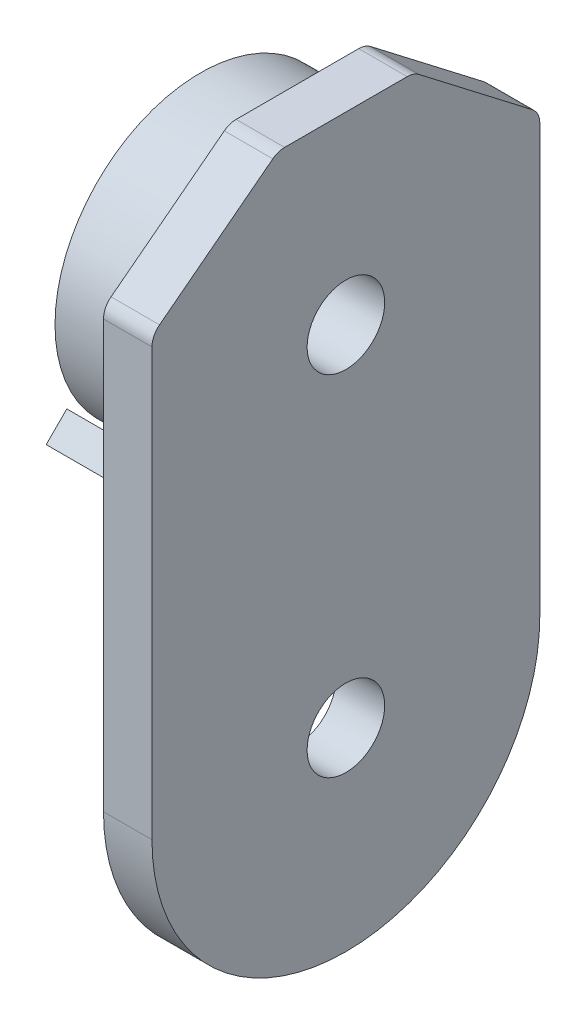
ISO-10303-21;
HEADER;
FILE_DESCRIPTION(('STEP AP214'),'2;1');
FILE_NAME('part.step','',(''),(''),'','','');
FILE_SCHEMA(('AUTOMOTIVE_DESIGN { 1 0 10303 214 1 1 1 1 }'));
ENDSEC;
DATA;
#1=APPLICATION_CONTEXT('core data for automotive mechanical design processes');
#2=APPLICATION_PROTOCOL_DEFINITION('international standard','automotive_design',2000,#1);
#3=PRODUCT_CONTEXT('',#1,'mechanical');
#4=PRODUCT('Part','Part','',(#3));
#5=PRODUCT_RELATED_PRODUCT_CATEGORY('part','',(#4));
#6=PRODUCT_DEFINITION_FORMATION('','',#4);
#7=PRODUCT_DEFINITION_CONTEXT('part definition',#1,'design');
#8=PRODUCT_DEFINITION('design','',#6,#7);
#9=PRODUCT_DEFINITION_SHAPE('','',#8);
#10=(LENGTH_UNIT() NAMED_UNIT(*) SI_UNIT(.MILLI.,.METRE.));
#11=(NAMED_UNIT(*) PLANE_ANGLE_UNIT() SI_UNIT($,.RADIAN.));
#12=(NAMED_UNIT(*) SI_UNIT($,.STERADIAN.) SOLID_ANGLE_UNIT());
#13=UNCERTAINTY_MEASURE_WITH_UNIT(LENGTH_MEASURE(1.E-05),#10,'distance_accuracy_value','');
#14=(GEOMETRIC_REPRESENTATION_CONTEXT(3) GLOBAL_UNCERTAINTY_ASSIGNED_CONTEXT((#13)) GLOBAL_UNIT_ASSIGNED_CONTEXT((#10,
#11,#12)) REPRESENTATION_CONTEXT('',''));
#15=CARTESIAN_POINT('',(0.,0.,0.));
#16=DIRECTION('',(0.,0.,1.));
#17=DIRECTION('',(1.,0.,0.));
#18=AXIS2_PLACEMENT_3D('',#15,#16,#17);
#19=CARTESIAN_POINT('',(-5.,0.,0.));
#20=DIRECTION('',(1.,0.,0.));
#21=DIRECTION('',(0.,0.,-1.));
#22=AXIS2_PLACEMENT_3D('',#19,#20,#21);
#23=PLANE('',#22);
#24=CARTESIAN_POINT('',(-5.,0.,0.));
#25=DIRECTION('',(-1.,0.,0.));
#26=DIRECTION('',(0.,0.,1.));
#27=AXIS2_PLACEMENT_3D('',#24,#25,#26);
#28=CIRCLE('',#27,4.);
#29=CARTESIAN_POINT('',(-5.,0.,4.));
#30=VERTEX_POINT('',#29);
#31=EDGE_CURVE('E559',#30,#30,#28,.T.);
#32=ORIENTED_EDGE('',*,*,#31,.F.);
#33=EDGE_LOOP('',(#32));
#34=FACE_BOUND('',#33,.T.);
#35=DIRECTION('',(0.,0.609710760849692,0.7926239891046));
#36=VECTOR('',#35,1.);
#37=CARTESIAN_POINT('',(-5.,55.,-7.));
#38=LINE('',#37,#36);
#39=CARTESIAN_POINT('',(-5.,45.6004449833082,-19.2194215216994));
#40=VERTEX_POINT('',#39);
#41=CARTESIAN_POINT('',(-5.,54.5852479782092,-7.53917762832804));
#42=VERTEX_POINT('',#41);
#43=EDGE_CURVE('E243',#40,#42,#38,.T.);
#44=ORIENTED_EDGE('',*,*,#43,.F.);
#45=CARTESIAN_POINT('',(-5.,44.015197005099,-18.));
#46=DIRECTION('',(1.,0.,0.));
#47=DIRECTION('',(0.,0.,-1.));
#48=AXIS2_PLACEMENT_3D('',#45,#46,#47);
#49=CIRCLE('',#48,2.);
#50=CARTESIAN_POINT('',(-5.,44.0151970050989,-20.));
#51=VERTEX_POINT('',#50);
#52=EDGE_CURVE('E296',#40,#51,#49,.F.);
#53=ORIENTED_EDGE('',*,*,#52,.T.);
#54=DIRECTION('',(0.,1.,0.));
#55=VECTOR('',#54,1.);
#56=CARTESIAN_POINT('',(-5.,0.,-20.));
#57=LINE('',#56,#55);
#58=CARTESIAN_POINT('',(-5.,0.,-20.));
#59=VERTEX_POINT('',#58);
#60=EDGE_CURVE('E239',#59,#51,#57,.T.);
#61=ORIENTED_EDGE('',*,*,#60,.F.);
#62=CARTESIAN_POINT('',(-5.,0.,0.));
#63=DIRECTION('',(1.,0.,0.));
#64=DIRECTION('',(0.,0.,-1.));
#65=AXIS2_PLACEMENT_3D('',#62,#63,#64);
#66=CIRCLE('',#65,20.);
#67=CARTESIAN_POINT('',(-5.,0.,20.));
#68=VERTEX_POINT('',#67);
#69=EDGE_CURVE('E236',#68,#59,#66,.T.);
#70=ORIENTED_EDGE('',*,*,#69,.F.);
#71=DIRECTION('',(0.,-1.,0.));
#72=VECTOR('',#71,1.);
#73=CARTESIAN_POINT('',(-5.,0.,20.));
#74=LINE('',#73,#72);
#75=CARTESIAN_POINT('',(-5.,44.0151970050989,20.));
#76=VERTEX_POINT('',#75);
#77=EDGE_CURVE('E252',#76,#68,#74,.T.);
#78=ORIENTED_EDGE('',*,*,#77,.F.);
#79=CARTESIAN_POINT('',(-5.,44.015197005099,18.));
#80=DIRECTION('',(1.,0.,0.));
#81=DIRECTION('',(0.,0.,-1.));
#82=AXIS2_PLACEMENT_3D('',#79,#80,#81);
#83=CIRCLE('',#82,2.);
#84=CARTESIAN_POINT('',(-5.,45.6004449833082,19.2194215216994));
#85=VERTEX_POINT('',#84);
#86=EDGE_CURVE('E290',#76,#85,#83,.F.);
#87=ORIENTED_EDGE('',*,*,#86,.T.);
#88=DIRECTION('',(0.,-0.609710760849692,0.7926239891046));
#89=VECTOR('',#88,1.);
#90=CARTESIAN_POINT('',(-5.,45.,20.));
#91=LINE('',#90,#89);
#92=CARTESIAN_POINT('',(-5.,54.5852479782092,7.53917762832805));
#93=VERTEX_POINT('',#92);
#94=EDGE_CURVE('E249',#93,#85,#91,.T.);
#95=ORIENTED_EDGE('',*,*,#94,.F.);
#96=CARTESIAN_POINT('',(-5.,53.,6.31975610662866));
#97=DIRECTION('',(1.,0.,0.));
#98=DIRECTION('',(0.,0.,-1.));
#99=AXIS2_PLACEMENT_3D('',#96,#97,#98);
#100=CIRCLE('',#99,2.);
#101=CARTESIAN_POINT('',(-5.,55.,6.31975610662866));
#102=VERTEX_POINT('',#101);
#103=EDGE_CURVE('E292',#93,#102,#100,.F.);
#104=ORIENTED_EDGE('',*,*,#103,.T.);
#105=DIRECTION('',(0.,0.,1.));
#106=VECTOR('',#105,1.);
#107=CARTESIAN_POINT('',(-5.,55.,7.));
#108=LINE('',#107,#106);
#109=CARTESIAN_POINT('',(-5.,55.,-6.31975610662865));
#110=VERTEX_POINT('',#109);
#111=EDGE_CURVE('E246',#110,#102,#108,.T.);
#112=ORIENTED_EDGE('',*,*,#111,.F.);
#113=CARTESIAN_POINT('',(-5.,53.,-6.31975610662866));
#114=DIRECTION('',(1.,0.,0.));
#115=DIRECTION('',(0.,0.,-1.));
#116=AXIS2_PLACEMENT_3D('',#113,#114,#115);
#117=CIRCLE('',#116,2.);
#118=EDGE_CURVE('E294',#110,#42,#117,.F.);
#119=ORIENTED_EDGE('',*,*,#118,.T.);
#120=EDGE_LOOP('',(#44,#53,#61,#70,#78,#87,#95,#104,#112,#119));
#121=FACE_BOUND('',#120,.T.);
#122=CARTESIAN_POINT('',(-5.,36.,0.));
#123=DIRECTION('',(-1.,0.,0.));
#124=DIRECTION('',(0.,0.,1.));
#125=AXIS2_PLACEMENT_3D('',#122,#123,#124);
#126=CIRCLE('',#125,15.);
#127=CARTESIAN_POINT('',(-5.,36.,15.));
#128=VERTEX_POINT('',#127);
#129=EDGE_CURVE('E11',#128,#128,#126,.T.);
#130=ORIENTED_EDGE('',*,*,#129,.F.);
#131=EDGE_LOOP('',(#130));
#132=FACE_BOUND('',#131,.T.);
#133=DIRECTION('',(0.,0.707106781186553,-0.707106781186542));
#134=VECTOR('',#133,1.);
#135=CARTESIAN_POINT('',(-5.,25.746951672795,15.9099025766973));
#136=LINE('',#135,#134);
#137=CARTESIAN_POINT('',(-5.,25.746951672795,15.9099025766973));
#138=VERTEX_POINT('',#137);
#139=CARTESIAN_POINT('',(-5.,27.8739759746428,13.7828782748495));
#140=VERTEX_POINT('',#139);
#141=EDGE_CURVE('E171',#138,#140,#136,.T.);
#142=ORIENTED_EDGE('',*,*,#141,.F.);
#143=DIRECTION('',(0.,0.707106781186544,0.707106781186551));
#144=VECTOR('',#143,1.);
#145=CARTESIAN_POINT('',(-5.,25.746951672795,15.9099025766973));
#146=LINE('',#145,#144);
#147=CARTESIAN_POINT('',(-5.,20.0900974233026,10.2530483272049));
#148=VERTEX_POINT('',#147);
#149=EDGE_CURVE('E207',#148,#138,#146,.T.);
#150=ORIENTED_EDGE('',*,*,#149,.F.);
#151=DIRECTION('',(0.,-0.707106781186551,0.707106781186544));
#152=VECTOR('',#151,1.);
#153=CARTESIAN_POINT('',(-5.,20.0900974233026,10.2530483272049));
#154=LINE('',#153,#152);
#155=CARTESIAN_POINT('',(-5.,22.2171217251504,8.12602402535705));
#156=VERTEX_POINT('',#155);
#157=EDGE_CURVE('E217',#156,#148,#154,.T.);
#158=ORIENTED_EDGE('',*,*,#157,.F.);
#159=CARTESIAN_POINT('',(-5.,36.,0.));
#160=DIRECTION('',(1.,0.,0.));
#161=DIRECTION('',(0.,0.,1.));
#162=AXIS2_PLACEMENT_3D('',#159,#160,#161);
#163=CIRCLE('',#162,16.);
#164=EDGE_CURVE('E58',#140,#156,#163,.T.);
#165=ORIENTED_EDGE('',*,*,#164,.F.);
#166=EDGE_LOOP('',(#142,#150,#158,#165));
#167=FACE_BOUND('',#166,.T.);
#168=DIRECTION('',(0.,0.707106781186544,-0.707106781186551));
#169=VECTOR('',#168,1.);
#170=CARTESIAN_POINT('',(-5.,25.746951672795,-15.9099025766973));
#171=LINE('',#170,#169);
#172=CARTESIAN_POINT('',(-5.,20.0900974233026,-10.2530483272049));
#173=VERTEX_POINT('',#172);
#174=CARTESIAN_POINT('',(-5.,25.746951672795,-15.9099025766973));
#175=VERTEX_POINT('',#174);
#176=EDGE_CURVE('E193',#173,#175,#171,.T.);
#177=ORIENTED_EDGE('',*,*,#176,.T.);
#178=DIRECTION('',(0.,0.707106781186553,0.707106781186542));
#179=VECTOR('',#178,1.);
#180=CARTESIAN_POINT('',(-5.,25.746951672795,-15.9099025766973));
#181=LINE('',#180,#179);
#182=CARTESIAN_POINT('',(-5.,27.8739759746428,-13.7828782748495));
#183=VERTEX_POINT('',#182);
#184=EDGE_CURVE('E166',#175,#183,#181,.T.);
#185=ORIENTED_EDGE('',*,*,#184,.T.);
#186=CARTESIAN_POINT('',(-5.,36.,0.));
#187=DIRECTION('',(-1.,0.,0.));
#188=DIRECTION('',(0.,0.,-1.));
#189=AXIS2_PLACEMENT_3D('',#186,#187,#188);
#190=CIRCLE('',#189,16.);
#191=CARTESIAN_POINT('',(-5.,22.2171217251504,-8.12602402535705));
#192=VERTEX_POINT('',#191);
#193=EDGE_CURVE('E182',#183,#192,#190,.T.);
#194=ORIENTED_EDGE('',*,*,#193,.T.);
#195=DIRECTION('',(0.,-0.707106781186551,-0.707106781186544));
#196=VECTOR('',#195,1.);
#197=CARTESIAN_POINT('',(-5.,20.0900974233026,-10.2530483272049));
#198=LINE('',#197,#196);
#199=EDGE_CURVE('E50',#192,#173,#198,.T.);
#200=ORIENTED_EDGE('',*,*,#199,.T.);
#201=EDGE_LOOP('',(#177,#185,#194,#200));
#202=FACE_BOUND('',#201,.T.);
#203=ADVANCED_FACE('F34',(#34,#121,#132,#167,#202),#23,.F.);
#204=CARTESIAN_POINT('',(-5.,0.,0.));
#205=DIRECTION('',(1.,0.,0.));
#206=DIRECTION('',(0.,0.,-1.));
#207=AXIS2_PLACEMENT_3D('',#204,#205,#206);
#208=CYLINDRICAL_SURFACE('',#207,20.);
#209=CARTESIAN_POINT('',(0.,0.,0.));
#210=DIRECTION('',(1.,0.,0.));
#211=DIRECTION('',(0.,0.,-1.));
#212=AXIS2_PLACEMENT_3D('',#209,#210,#211);
#213=CIRCLE('',#212,20.);
#214=CARTESIAN_POINT('',(0.,0.,20.));
#215=VERTEX_POINT('',#214);
#216=CARTESIAN_POINT('',(0.,0.,-20.));
#217=VERTEX_POINT('',#216);
#218=EDGE_CURVE('E234',#215,#217,#213,.T.);
#219=ORIENTED_EDGE('',*,*,#218,.F.);
#220=DIRECTION('',(1.,0.,0.));
#221=VECTOR('',#220,1.);
#222=CARTESIAN_POINT('',(-5.,0.,20.));
#223=LINE('',#222,#221);
#224=EDGE_CURVE('E270',#68,#215,#223,.T.);
#225=ORIENTED_EDGE('',*,*,#224,.F.);
#226=ORIENTED_EDGE('',*,*,#69,.T.);
#227=DIRECTION('',(1.,0.,0.));
#228=VECTOR('',#227,1.);
#229=CARTESIAN_POINT('',(-5.,0.,-20.));
#230=LINE('',#229,#228);
#231=EDGE_CURVE('E254',#59,#217,#230,.T.);
#232=ORIENTED_EDGE('',*,*,#231,.T.);
#233=EDGE_LOOP('',(#219,#225,#226,#232));
#234=FACE_BOUND('',#233,.T.);
#235=ADVANCED_FACE('F353',(#234),#208,.T.);
#236=CARTESIAN_POINT('',(-5.,0.,20.));
#237=DIRECTION('',(0.,0.,1.));
#238=DIRECTION('',(1.,0.,0.));
#239=AXIS2_PLACEMENT_3D('',#236,#237,#238);
#240=PLANE('',#239);
#241=DIRECTION('',(0.,-1.,0.));
#242=VECTOR('',#241,1.);
#243=CARTESIAN_POINT('',(0.,0.,20.));
#244=LINE('',#243,#242);
#245=CARTESIAN_POINT('',(0.,44.0151970050989,20.));
#246=VERTEX_POINT('',#245);
#247=EDGE_CURVE('E240',#246,#215,#244,.T.);
#248=ORIENTED_EDGE('',*,*,#247,.F.);
#249=DIRECTION('',(1.,0.,0.));
#250=VECTOR('',#249,1.);
#251=CARTESIAN_POINT('',(-5.,44.015197005099,20.));
#252=LINE('',#251,#250);
#253=EDGE_CURVE('E38',#246,#76,#252,.F.);
#254=ORIENTED_EDGE('',*,*,#253,.T.);
#255=ORIENTED_EDGE('',*,*,#77,.T.);
#256=ORIENTED_EDGE('',*,*,#224,.T.);
#257=EDGE_LOOP('',(#248,#254,#255,#256));
#258=FACE_BOUND('',#257,.T.);
#259=ADVANCED_FACE('F314',(#258),#240,.T.);
#260=CARTESIAN_POINT('',(-5.,45.,20.));
#261=DIRECTION('',(0.,0.7926239891046,0.609710760849692));
#262=DIRECTION('',(0.,-0.609710760849693,0.7926239891046));
#263=AXIS2_PLACEMENT_3D('',#260,#261,#262);
#264=PLANE('',#263);
#265=DIRECTION('',(0.,-0.609710760849692,0.7926239891046));
#266=VECTOR('',#265,1.);
#267=CARTESIAN_POINT('',(0.,45.,20.));
#268=LINE('',#267,#266);
#269=CARTESIAN_POINT('',(0.,54.5852479782092,7.53917762832805));
#270=VERTEX_POINT('',#269);
#271=CARTESIAN_POINT('',(0.,45.6004449833082,19.2194215216994));
#272=VERTEX_POINT('',#271);
#273=EDGE_CURVE('E266',#270,#272,#268,.T.);
#274=ORIENTED_EDGE('',*,*,#273,.F.);
#275=DIRECTION('',(1.,0.,0.));
#276=VECTOR('',#275,1.);
#277=CARTESIAN_POINT('',(-5.,54.5852479782092,7.53917762832804));
#278=LINE('',#277,#276);
#279=EDGE_CURVE('E305',#270,#93,#278,.F.);
#280=ORIENTED_EDGE('',*,*,#279,.T.);
#281=ORIENTED_EDGE('',*,*,#94,.T.);
#282=DIRECTION('',(1.,0.,0.));
#283=VECTOR('',#282,1.);
#284=CARTESIAN_POINT('',(-5.,45.6004449833082,19.2194215216994));
#285=LINE('',#284,#283);
#286=EDGE_CURVE('E303',#85,#272,#285,.T.);
#287=ORIENTED_EDGE('',*,*,#286,.T.);
#288=EDGE_LOOP('',(#274,#280,#281,#287));
#289=FACE_BOUND('',#288,.T.);
#290=ADVANCED_FACE('F324',(#289),#264,.T.);
#291=CARTESIAN_POINT('',(-5.,55.,7.));
#292=DIRECTION('',(0.,1.,0.));
#293=DIRECTION('',(0.,0.,1.));
#294=AXIS2_PLACEMENT_3D('',#291,#292,#293);
#295=PLANE('',#294);
#296=DIRECTION('',(0.,0.,1.));
#297=VECTOR('',#296,1.);
#298=CARTESIAN_POINT('',(0.,55.,7.));
#299=LINE('',#298,#297);
#300=CARTESIAN_POINT('',(0.,55.,-6.31975610662865));
#301=VERTEX_POINT('',#300);
#302=CARTESIAN_POINT('',(0.,55.,6.31975610662866));
#303=VERTEX_POINT('',#302);
#304=EDGE_CURVE('E263',#301,#303,#299,.T.);
#305=ORIENTED_EDGE('',*,*,#304,.F.);
#306=DIRECTION('',(1.,0.,0.));
#307=VECTOR('',#306,1.);
#308=CARTESIAN_POINT('',(-5.,55.,-6.31975610662866));
#309=LINE('',#308,#307);
#310=EDGE_CURVE('E301',#301,#110,#309,.F.);
#311=ORIENTED_EDGE('',*,*,#310,.T.);
#312=ORIENTED_EDGE('',*,*,#111,.T.);
#313=DIRECTION('',(1.,0.,0.));
#314=VECTOR('',#313,1.);
#315=CARTESIAN_POINT('',(-5.,55.,6.31975610662866));
#316=LINE('',#315,#314);
#317=EDGE_CURVE('E298',#102,#303,#316,.T.);
#318=ORIENTED_EDGE('',*,*,#317,.T.);
#319=EDGE_LOOP('',(#305,#311,#312,#318));
#320=FACE_BOUND('',#319,.T.);
#321=ADVANCED_FACE('F333',(#320),#295,.T.);
#322=CARTESIAN_POINT('',(-5.,55.,-7.));
#323=DIRECTION('',(0.,0.7926239891046,-0.609710760849692));
#324=DIRECTION('',(0.,0.609710760849693,0.7926239891046));
#325=AXIS2_PLACEMENT_3D('',#322,#323,#324);
#326=PLANE('',#325);
#327=DIRECTION('',(0.,0.609710760849692,0.7926239891046));
#328=VECTOR('',#327,1.);
#329=CARTESIAN_POINT('',(0.,55.,-7.));
#330=LINE('',#329,#328);
#331=CARTESIAN_POINT('',(0.,45.6004449833082,-19.2194215216994));
#332=VERTEX_POINT('',#331);
#333=CARTESIAN_POINT('',(0.,54.5852479782092,-7.53917762832804));
#334=VERTEX_POINT('',#333);
#335=EDGE_CURVE('E260',#332,#334,#330,.T.);
#336=ORIENTED_EDGE('',*,*,#335,.F.);
#337=DIRECTION('',(1.,0.,0.));
#338=VECTOR('',#337,1.);
#339=CARTESIAN_POINT('',(-5.,45.6004449833082,-19.2194215216994));
#340=LINE('',#339,#338);
#341=EDGE_CURVE('E288',#332,#40,#340,.F.);
#342=ORIENTED_EDGE('',*,*,#341,.T.);
#343=ORIENTED_EDGE('',*,*,#43,.T.);
#344=DIRECTION('',(1.,0.,0.));
#345=VECTOR('',#344,1.);
#346=CARTESIAN_POINT('',(-5.,54.5852479782092,-7.53917762832804));
#347=LINE('',#346,#345);
#348=EDGE_CURVE('E285',#42,#334,#347,.T.);
#349=ORIENTED_EDGE('',*,*,#348,.T.);
#350=EDGE_LOOP('',(#336,#342,#343,#349));
#351=FACE_BOUND('',#350,.T.);
#352=ADVANCED_FACE('F342',(#351),#326,.T.);
#353=CARTESIAN_POINT('',(-5.,0.,-20.));
#354=DIRECTION('',(0.,0.,-1.));
#355=DIRECTION('',(-1.,0.,0.));
#356=AXIS2_PLACEMENT_3D('',#353,#354,#355);
#357=PLANE('',#356);
#358=ORIENTED_EDGE('',*,*,#60,.T.);
#359=DIRECTION('',(1.,0.,0.));
#360=VECTOR('',#359,1.);
#361=CARTESIAN_POINT('',(-5.,44.015197005099,-20.));
#362=LINE('',#361,#360);
#363=CARTESIAN_POINT('',(0.,44.0151970050989,-20.));
#364=VERTEX_POINT('',#363);
#365=EDGE_CURVE('E273',#51,#364,#362,.T.);
#366=ORIENTED_EDGE('',*,*,#365,.T.);
#367=DIRECTION('',(0.,1.,0.));
#368=VECTOR('',#367,1.);
#369=CARTESIAN_POINT('',(0.,0.,-20.));
#370=LINE('',#369,#368);
#371=EDGE_CURVE('E257',#217,#364,#370,.T.);
#372=ORIENTED_EDGE('',*,*,#371,.F.);
#373=ORIENTED_EDGE('',*,*,#231,.F.);
#374=EDGE_LOOP('',(#358,#366,#372,#373));
#375=FACE_BOUND('',#374,.T.);
#376=ADVANCED_FACE('F350',(#375),#357,.T.);
#377=CARTESIAN_POINT('',(0.,0.,0.));
#378=DIRECTION('',(1.,0.,0.));
#379=DIRECTION('',(0.,0.,-1.));
#380=AXIS2_PLACEMENT_3D('',#377,#378,#379);
#381=PLANE('',#380);
#382=CARTESIAN_POINT('',(0.,0.,0.));
#383=DIRECTION('',(1.,0.,0.));
#384=DIRECTION('',(0.,0.,-1.));
#385=AXIS2_PLACEMENT_3D('',#382,#383,#384);
#386=CIRCLE('',#385,4.);
#387=CARTESIAN_POINT('',(0.,0.,-4.));
#388=VERTEX_POINT('',#387);
#389=EDGE_CURVE('E556',#388,#388,#386,.F.);
#390=ORIENTED_EDGE('',*,*,#389,.T.);
#391=EDGE_LOOP('',(#390));
#392=FACE_BOUND('',#391,.T.);
#393=CARTESIAN_POINT('',(0.,36.,0.));
#394=DIRECTION('',(1.,0.,0.));
#395=DIRECTION('',(0.,0.,-1.));
#396=AXIS2_PLACEMENT_3D('',#393,#394,#395);
#397=CIRCLE('',#396,4.);
#398=CARTESIAN_POINT('',(0.,36.,-4.));
#399=VERTEX_POINT('',#398);
#400=EDGE_CURVE('E560',#399,#399,#397,.F.);
#401=ORIENTED_EDGE('',*,*,#400,.T.);
#402=EDGE_LOOP('',(#401));
#403=FACE_BOUND('',#402,.T.);
#404=ORIENTED_EDGE('',*,*,#371,.T.);
#405=CARTESIAN_POINT('',(0.,44.015197005099,-18.));
#406=DIRECTION('',(1.,0.,0.));
#407=DIRECTION('',(0.,0.,-1.));
#408=AXIS2_PLACEMENT_3D('',#405,#406,#407);
#409=CIRCLE('',#408,2.);
#410=EDGE_CURVE('E283',#364,#332,#409,.T.);
#411=ORIENTED_EDGE('',*,*,#410,.T.);
#412=ORIENTED_EDGE('',*,*,#335,.T.);
#413=CARTESIAN_POINT('',(0.,53.,-6.31975610662866));
#414=DIRECTION('',(1.,0.,0.));
#415=DIRECTION('',(0.,0.,-1.));
#416=AXIS2_PLACEMENT_3D('',#413,#414,#415);
#417=CIRCLE('',#416,2.);
#418=EDGE_CURVE('E281',#334,#301,#417,.T.);
#419=ORIENTED_EDGE('',*,*,#418,.T.);
#420=ORIENTED_EDGE('',*,*,#304,.T.);
#421=CARTESIAN_POINT('',(0.,53.,6.31975610662866));
#422=DIRECTION('',(1.,0.,0.));
#423=DIRECTION('',(0.,0.,-1.));
#424=AXIS2_PLACEMENT_3D('',#421,#422,#423);
#425=CIRCLE('',#424,2.);
#426=EDGE_CURVE('E279',#303,#270,#425,.T.);
#427=ORIENTED_EDGE('',*,*,#426,.T.);
#428=ORIENTED_EDGE('',*,*,#273,.T.);
#429=CARTESIAN_POINT('',(0.,44.015197005099,18.));
#430=DIRECTION('',(1.,0.,0.));
#431=DIRECTION('',(0.,0.,-1.));
#432=AXIS2_PLACEMENT_3D('',#429,#430,#431);
#433=CIRCLE('',#432,2.);
#434=EDGE_CURVE('E277',#272,#246,#433,.T.);
#435=ORIENTED_EDGE('',*,*,#434,.T.);
#436=ORIENTED_EDGE('',*,*,#247,.T.);
#437=ORIENTED_EDGE('',*,*,#218,.T.);
#438=EDGE_LOOP('',(#404,#411,#412,#419,#420,#427,#428,#435,#436,#437));
#439=FACE_BOUND('',#438,.T.);
#440=ADVANCED_FACE('F326',(#392,#403,#439),#381,.T.);
#441=CARTESIAN_POINT('',(-5.,44.015197005099,-18.));
#442=DIRECTION('',(1.,0.,0.));
#443=DIRECTION('',(0.,0.,-1.));
#444=AXIS2_PLACEMENT_3D('',#441,#442,#443);
#445=CYLINDRICAL_SURFACE('',#444,2.);
#446=ORIENTED_EDGE('',*,*,#52,.F.);
#447=ORIENTED_EDGE('',*,*,#341,.F.);
#448=ORIENTED_EDGE('',*,*,#410,.F.);
#449=ORIENTED_EDGE('',*,*,#365,.F.);
#450=EDGE_LOOP('',(#446,#447,#448,#449));
#451=FACE_BOUND('',#450,.T.);
#452=ADVANCED_FACE('F348',(#451),#445,.T.);
#453=CARTESIAN_POINT('',(-5.,53.,-6.31975610662866));
#454=DIRECTION('',(1.,0.,0.));
#455=DIRECTION('',(0.,0.,-1.));
#456=AXIS2_PLACEMENT_3D('',#453,#454,#455);
#457=CYLINDRICAL_SURFACE('',#456,2.);
#458=ORIENTED_EDGE('',*,*,#118,.F.);
#459=ORIENTED_EDGE('',*,*,#310,.F.);
#460=ORIENTED_EDGE('',*,*,#418,.F.);
#461=ORIENTED_EDGE('',*,*,#348,.F.);
#462=EDGE_LOOP('',(#458,#459,#460,#461));
#463=FACE_BOUND('',#462,.T.);
#464=ADVANCED_FACE('F339',(#463),#457,.T.);
#465=CARTESIAN_POINT('',(-5.,53.,6.31975610662866));
#466=DIRECTION('',(1.,0.,0.));
#467=DIRECTION('',(0.,0.,-1.));
#468=AXIS2_PLACEMENT_3D('',#465,#466,#467);
#469=CYLINDRICAL_SURFACE('',#468,2.);
#470=ORIENTED_EDGE('',*,*,#103,.F.);
#471=ORIENTED_EDGE('',*,*,#279,.F.);
#472=ORIENTED_EDGE('',*,*,#426,.F.);
#473=ORIENTED_EDGE('',*,*,#317,.F.);
#474=EDGE_LOOP('',(#470,#471,#472,#473));
#475=FACE_BOUND('',#474,.T.);
#476=ADVANCED_FACE('F331',(#475),#469,.T.);
#477=CARTESIAN_POINT('',(-5.,44.015197005099,18.));
#478=DIRECTION('',(1.,0.,0.));
#479=DIRECTION('',(0.,0.,-1.));
#480=AXIS2_PLACEMENT_3D('',#477,#478,#479);
#481=CYLINDRICAL_SURFACE('',#480,2.);
#482=ORIENTED_EDGE('',*,*,#86,.F.);
#483=ORIENTED_EDGE('',*,*,#253,.F.);
#484=ORIENTED_EDGE('',*,*,#434,.F.);
#485=ORIENTED_EDGE('',*,*,#286,.F.);
#486=EDGE_LOOP('',(#482,#483,#484,#485));
#487=FACE_BOUND('',#486,.T.);
#488=ADVANCED_FACE('F36',(#487),#481,.T.);
#489=CARTESIAN_POINT('',(-15.,36.,0.));
#490=DIRECTION('',(1.,0.,0.));
#491=DIRECTION('',(0.,0.,-1.));
#492=AXIS2_PLACEMENT_3D('',#489,#490,#491);
#493=CYLINDRICAL_SURFACE('',#492,15.);
#494=CARTESIAN_POINT('',(-15.,36.,0.));
#495=DIRECTION('',(-1.,0.,0.));
#496=DIRECTION('',(0.,0.,1.));
#497=AXIS2_PLACEMENT_3D('',#494,#495,#496);
#498=CIRCLE('',#497,15.);
#499=CARTESIAN_POINT('',(-15.,36.,15.));
#500=VERTEX_POINT('',#499);
#501=EDGE_CURVE('E232',#500,#500,#498,.T.);
#502=ORIENTED_EDGE('',*,*,#501,.F.);
#503=EDGE_LOOP('',(#502));
#504=FACE_BOUND('',#503,.T.);
#505=ORIENTED_EDGE('',*,*,#129,.T.);
#506=EDGE_LOOP('',(#505));
#507=FACE_BOUND('',#506,.T.);
#508=ADVANCED_FACE('F373',(#504,#507),#493,.T.);
#509=CARTESIAN_POINT('',(-15.,36.,0.));
#510=DIRECTION('',(-1.,0.,0.));
#511=DIRECTION('',(0.,0.,1.));
#512=AXIS2_PLACEMENT_3D('',#509,#510,#511);
#513=PLANE('',#512);
#514=CARTESIAN_POINT('',(-15.,36.,0.));
#515=DIRECTION('',(-1.,0.,0.));
#516=DIRECTION('',(0.,0.,1.));
#517=AXIS2_PLACEMENT_3D('',#514,#515,#516);
#518=CIRCLE('',#517,4.);
#519=CARTESIAN_POINT('',(-15.,36.,4.));
#520=VERTEX_POINT('',#519);
#521=EDGE_CURVE('E194',#520,#520,#518,.T.);
#522=ORIENTED_EDGE('',*,*,#521,.F.);
#523=EDGE_LOOP('',(#522));
#524=FACE_BOUND('',#523,.T.);
#525=ORIENTED_EDGE('',*,*,#501,.T.);
#526=EDGE_LOOP('',(#525));
#527=FACE_BOUND('',#526,.T.);
#528=ADVANCED_FACE('F377',(#524,#527),#513,.T.);
#529=CARTESIAN_POINT('',(-15.,25.746951672795,15.9099025766973));
#530=DIRECTION('',(0.,-0.707106781186542,-0.707106781186553));
#531=DIRECTION('',(0.,0.707106781186553,-0.707106781186542));
#532=AXIS2_PLACEMENT_3D('',#529,#530,#531);
#533=PLANE('',#532);
#534=ORIENTED_EDGE('',*,*,#141,.T.);
#535=DIRECTION('',(1.,0.,0.));
#536=VECTOR('',#535,1.);
#537=CARTESIAN_POINT('',(-15.,27.8739759746428,13.7828782748495));
#538=LINE('',#537,#536);
#539=CARTESIAN_POINT('',(-15.,27.8739759746428,13.7828782748495));
#540=VERTEX_POINT('',#539);
#541=EDGE_CURVE('E230',#540,#140,#538,.T.);
#542=ORIENTED_EDGE('',*,*,#541,.F.);
#543=DIRECTION('',(0.,0.707106781186553,-0.707106781186542));
#544=VECTOR('',#543,1.);
#545=CARTESIAN_POINT('',(-15.,25.746951672795,15.9099025766973));
#546=LINE('',#545,#544);
#547=CARTESIAN_POINT('',(-15.,25.746951672795,15.9099025766973));
#548=VERTEX_POINT('',#547);
#549=EDGE_CURVE('E203',#548,#540,#546,.T.);
#550=ORIENTED_EDGE('',*,*,#549,.F.);
#551=DIRECTION('',(1.,0.,0.));
#552=VECTOR('',#551,1.);
#553=CARTESIAN_POINT('',(-15.,25.746951672795,15.9099025766973));
#554=LINE('',#553,#552);
#555=EDGE_CURVE('E213',#548,#138,#554,.T.);
#556=ORIENTED_EDGE('',*,*,#555,.T.);
#557=EDGE_LOOP('',(#534,#542,#550,#556));
#558=FACE_BOUND('',#557,.T.);
#559=ADVANCED_FACE('F383',(#558),#533,.F.);
#560=CARTESIAN_POINT('',(-15.,36.,0.));
#561=DIRECTION('',(1.,0.,0.));
#562=DIRECTION('',(0.,0.,-1.));
#563=AXIS2_PLACEMENT_3D('',#560,#561,#562);
#564=CYLINDRICAL_SURFACE('',#563,16.);
#565=ORIENTED_EDGE('',*,*,#164,.T.);
#566=DIRECTION('',(1.,0.,0.));
#567=VECTOR('',#566,1.);
#568=CARTESIAN_POINT('',(-15.,22.2171217251504,8.12602402535705));
#569=LINE('',#568,#567);
#570=CARTESIAN_POINT('',(-15.,22.2171217251504,8.12602402535705));
#571=VERTEX_POINT('',#570);
#572=EDGE_CURVE('E227',#571,#156,#569,.T.);
#573=ORIENTED_EDGE('',*,*,#572,.F.);
#574=CARTESIAN_POINT('',(-15.,36.,0.));
#575=DIRECTION('',(1.,0.,0.));
#576=DIRECTION('',(0.,0.,1.));
#577=AXIS2_PLACEMENT_3D('',#574,#575,#576);
#578=CIRCLE('',#577,16.);
#579=EDGE_CURVE('E206',#540,#571,#578,.T.);
#580=ORIENTED_EDGE('',*,*,#579,.F.);
#581=ORIENTED_EDGE('',*,*,#541,.T.);
#582=EDGE_LOOP('',(#565,#573,#580,#581));
#583=FACE_BOUND('',#582,.T.);
#584=ADVANCED_FACE('F438',(#583),#564,.F.);
#585=CARTESIAN_POINT('',(-15.,20.0900974233026,10.2530483272049));
#586=DIRECTION('',(0.,0.707106781186544,0.707106781186551));
#587=DIRECTION('',(0.,-0.707106781186551,0.707106781186544));
#588=AXIS2_PLACEMENT_3D('',#585,#586,#587);
#589=PLANE('',#588);
#590=ORIENTED_EDGE('',*,*,#157,.T.);
#591=DIRECTION('',(1.,0.,0.));
#592=VECTOR('',#591,1.);
#593=CARTESIAN_POINT('',(-15.,20.0900974233026,10.2530483272049));
#594=LINE('',#593,#592);
#595=CARTESIAN_POINT('',(-15.,20.0900974233026,10.2530483272049));
#596=VERTEX_POINT('',#595);
#597=EDGE_CURVE('E224',#596,#148,#594,.T.);
#598=ORIENTED_EDGE('',*,*,#597,.F.);
#599=DIRECTION('',(0.,-0.707106781186551,0.707106781186544));
#600=VECTOR('',#599,1.);
#601=CARTESIAN_POINT('',(-15.,20.0900974233026,10.2530483272049));
#602=LINE('',#601,#600);
#603=EDGE_CURVE('E209',#571,#596,#602,.T.);
#604=ORIENTED_EDGE('',*,*,#603,.F.);
#605=ORIENTED_EDGE('',*,*,#572,.T.);
#606=EDGE_LOOP('',(#590,#598,#604,#605));
#607=FACE_BOUND('',#606,.T.);
#608=ADVANCED_FACE('F447',(#607),#589,.F.);
#609=CARTESIAN_POINT('',(-15.,25.746951672795,15.9099025766973));
#610=DIRECTION('',(0.,0.707106781186551,-0.707106781186544));
#611=DIRECTION('',(0.,0.707106781186544,0.707106781186551));
#612=AXIS2_PLACEMENT_3D('',#609,#610,#611);
#613=PLANE('',#612);
#614=ORIENTED_EDGE('',*,*,#149,.T.);
#615=ORIENTED_EDGE('',*,*,#555,.F.);
#616=DIRECTION('',(0.,0.707106781186544,0.707106781186551));
#617=VECTOR('',#616,1.);
#618=CARTESIAN_POINT('',(-15.,25.746951672795,15.9099025766973));
#619=LINE('',#618,#617);
#620=EDGE_CURVE('E211',#596,#548,#619,.T.);
#621=ORIENTED_EDGE('',*,*,#620,.F.);
#622=ORIENTED_EDGE('',*,*,#597,.T.);
#623=EDGE_LOOP('',(#614,#615,#621,#622));
#624=FACE_BOUND('',#623,.T.);
#625=ADVANCED_FACE('F457',(#624),#613,.F.);
#626=CARTESIAN_POINT('',(-15.,36.,0.));
#627=DIRECTION('',(-1.,0.,0.));
#628=DIRECTION('',(0.,0.,1.));
#629=AXIS2_PLACEMENT_3D('',#626,#627,#628);
#630=PLANE('',#629);
#631=ORIENTED_EDGE('',*,*,#549,.T.);
#632=ORIENTED_EDGE('',*,*,#579,.T.);
#633=ORIENTED_EDGE('',*,*,#603,.T.);
#634=ORIENTED_EDGE('',*,*,#620,.T.);
#635=EDGE_LOOP('',(#631,#632,#633,#634));
#636=FACE_BOUND('',#635,.T.);
#637=ADVANCED_FACE('F467',(#636),#630,.T.);
#638=CARTESIAN_POINT('',(-15.,25.746951672795,-15.9099025766973));
#639=DIRECTION('',(0.,0.707106781186542,-0.707106781186553));
#640=DIRECTION('',(0.,0.707106781186553,0.707106781186542));
#641=AXIS2_PLACEMENT_3D('',#638,#639,#640);
#642=PLANE('',#641);
#643=ORIENTED_EDGE('',*,*,#184,.F.);
#644=DIRECTION('',(1.,0.,0.));
#645=VECTOR('',#644,1.);
#646=CARTESIAN_POINT('',(-15.,25.746951672795,-15.9099025766973));
#647=LINE('',#646,#645);
#648=CARTESIAN_POINT('',(-15.,25.746951672795,-15.9099025766973));
#649=VERTEX_POINT('',#648);
#650=EDGE_CURVE('E160',#649,#175,#647,.T.);
#651=ORIENTED_EDGE('',*,*,#650,.F.);
#652=DIRECTION('',(0.,0.707106781186553,0.707106781186542));
#653=VECTOR('',#652,1.);
#654=CARTESIAN_POINT('',(-15.,25.746951672795,-15.9099025766973));
#655=LINE('',#654,#653);
#656=CARTESIAN_POINT('',(-15.,27.8739759746428,-13.7828782748495));
#657=VERTEX_POINT('',#656);
#658=EDGE_CURVE('E163',#649,#657,#655,.T.);
#659=ORIENTED_EDGE('',*,*,#658,.T.);
#660=DIRECTION('',(1.,0.,0.));
#661=VECTOR('',#660,1.);
#662=CARTESIAN_POINT('',(-15.,27.8739759746428,-13.7828782748495));
#663=LINE('',#662,#661);
#664=EDGE_CURVE('E191',#657,#183,#663,.T.);
#665=ORIENTED_EDGE('',*,*,#664,.T.);
#666=EDGE_LOOP('',(#643,#651,#659,#665));
#667=FACE_BOUND('',#666,.T.);
#668=ADVANCED_FACE('F162',(#667),#642,.T.);
#669=CARTESIAN_POINT('',(-15.,25.746951672795,-15.9099025766973));
#670=DIRECTION('',(0.,-0.707106781186551,-0.707106781186544));
#671=DIRECTION('',(0.,0.707106781186544,-0.707106781186551));
#672=AXIS2_PLACEMENT_3D('',#669,#670,#671);
#673=PLANE('',#672);
#674=ORIENTED_EDGE('',*,*,#176,.F.);
#675=DIRECTION('',(1.,0.,0.));
#676=VECTOR('',#675,1.);
#677=CARTESIAN_POINT('',(-15.,20.0900974233026,-10.2530483272049));
#678=LINE('',#677,#676);
#679=CARTESIAN_POINT('',(-15.,20.0900974233026,-10.2530483272049));
#680=VERTEX_POINT('',#679);
#681=EDGE_CURVE('E172',#680,#173,#678,.T.);
#682=ORIENTED_EDGE('',*,*,#681,.F.);
#683=DIRECTION('',(0.,0.707106781186544,-0.707106781186551));
#684=VECTOR('',#683,1.);
#685=CARTESIAN_POINT('',(-15.,25.746951672795,-15.9099025766973));
#686=LINE('',#685,#684);
#687=EDGE_CURVE('E178',#680,#649,#686,.T.);
#688=ORIENTED_EDGE('',*,*,#687,.T.);
#689=ORIENTED_EDGE('',*,*,#650,.T.);
#690=EDGE_LOOP('',(#674,#682,#688,#689));
#691=FACE_BOUND('',#690,.T.);
#692=ADVANCED_FACE('F184',(#691),#673,.T.);
#693=CARTESIAN_POINT('',(-15.,20.0900974233026,-10.2530483272049));
#694=DIRECTION('',(0.,-0.707106781186544,0.707106781186551));
#695=DIRECTION('',(0.,-0.707106781186551,-0.707106781186544));
#696=AXIS2_PLACEMENT_3D('',#693,#694,#695);
#697=PLANE('',#696);
#698=ORIENTED_EDGE('',*,*,#199,.F.);
#699=DIRECTION('',(1.,0.,0.));
#700=VECTOR('',#699,1.);
#701=CARTESIAN_POINT('',(-15.,22.2171217251504,-8.12602402535705));
#702=LINE('',#701,#700);
#703=CARTESIAN_POINT('',(-15.,22.2171217251504,-8.12602402535705));
#704=VERTEX_POINT('',#703);
#705=EDGE_CURVE('E200',#704,#192,#702,.T.);
#706=ORIENTED_EDGE('',*,*,#705,.F.);
#707=DIRECTION('',(0.,-0.707106781186551,-0.707106781186544));
#708=VECTOR('',#707,1.);
#709=CARTESIAN_POINT('',(-15.,20.0900974233026,-10.2530483272049));
#710=LINE('',#709,#708);
#711=EDGE_CURVE('E185',#704,#680,#710,.T.);
#712=ORIENTED_EDGE('',*,*,#711,.T.);
#713=ORIENTED_EDGE('',*,*,#681,.T.);
#714=EDGE_LOOP('',(#698,#706,#712,#713));
#715=FACE_BOUND('',#714,.T.);
#716=ADVANCED_FACE('F495',(#715),#697,.T.);
#717=CARTESIAN_POINT('',(-15.,36.,0.));
#718=DIRECTION('',(1.,0.,0.));
#719=DIRECTION('',(0.,0.,-1.));
#720=AXIS2_PLACEMENT_3D('',#717,#718,#719);
#721=CYLINDRICAL_SURFACE('',#720,16.);
#722=ORIENTED_EDGE('',*,*,#193,.F.);
#723=ORIENTED_EDGE('',*,*,#664,.F.);
#724=CARTESIAN_POINT('',(-15.,36.,0.));
#725=DIRECTION('',(-1.,0.,0.));
#726=DIRECTION('',(0.,0.,-1.));
#727=AXIS2_PLACEMENT_3D('',#724,#725,#726);
#728=CIRCLE('',#727,16.);
#729=EDGE_CURVE('E181',#657,#704,#728,.T.);
#730=ORIENTED_EDGE('',*,*,#729,.T.);
#731=ORIENTED_EDGE('',*,*,#705,.T.);
#732=EDGE_LOOP('',(#722,#723,#730,#731));
#733=FACE_BOUND('',#732,.T.);
#734=ADVANCED_FACE('F504',(#733),#721,.F.);
#735=CARTESIAN_POINT('',(-15.,36.,0.));
#736=DIRECTION('',(-1.,0.,0.));
#737=DIRECTION('',(0.,0.,-1.));
#738=AXIS2_PLACEMENT_3D('',#735,#736,#737);
#739=PLANE('',#738);
#740=ORIENTED_EDGE('',*,*,#658,.F.);
#741=ORIENTED_EDGE('',*,*,#687,.F.);
#742=ORIENTED_EDGE('',*,*,#711,.F.);
#743=ORIENTED_EDGE('',*,*,#729,.F.);
#744=EDGE_LOOP('',(#740,#741,#742,#743));
#745=FACE_BOUND('',#744,.T.);
#746=ADVANCED_FACE('F176',(#745),#739,.T.);
#747=CARTESIAN_POINT('',(0.000999999999999265,36.,0.));
#748=DIRECTION('',(-1.,0.,0.));
#749=DIRECTION('',(0.,0.,1.));
#750=AXIS2_PLACEMENT_3D('',#747,#748,#749);
#751=CYLINDRICAL_SURFACE('',#750,4.);
#752=ORIENTED_EDGE('',*,*,#400,.F.);
#753=EDGE_LOOP('',(#752));
#754=FACE_BOUND('',#753,.T.);
#755=ORIENTED_EDGE('',*,*,#521,.T.);
#756=EDGE_LOOP('',(#755));
#757=FACE_BOUND('',#756,.T.);
#758=ADVANCED_FACE('F522',(#754,#757),#751,.F.);
#759=CARTESIAN_POINT('',(0.00100000000000013,0.,0.));
#760=DIRECTION('',(-1.,0.,0.));
#761=DIRECTION('',(0.,0.,1.));
#762=AXIS2_PLACEMENT_3D('',#759,#760,#761);
#763=CYLINDRICAL_SURFACE('',#762,4.);
#764=ORIENTED_EDGE('',*,*,#389,.F.);
#765=EDGE_LOOP('',(#764));
#766=FACE_BOUND('',#765,.T.);
#767=ORIENTED_EDGE('',*,*,#31,.T.);
#768=EDGE_LOOP('',(#767));
#769=FACE_BOUND('',#768,.T.);
#770=ADVANCED_FACE('F535',(#766,#769),#763,.F.);
#771=CLOSED_SHELL('',(#203,#235,#259,#290,#321,#352,#376,#440,#452,#464,#476,#488,#508,#528,
#559,#584,#608,#625,#637,#668,#692,#716,#734,#746,#758,#770));
#772=MANIFOLD_SOLID_BREP('B2',#771);
#773=ADVANCED_BREP_SHAPE_REPRESENTATION('',(#18,#772),#14);
#774=SHAPE_DEFINITION_REPRESENTATION(#9,#773);
ENDSEC;
END-ISO-10303-21;
